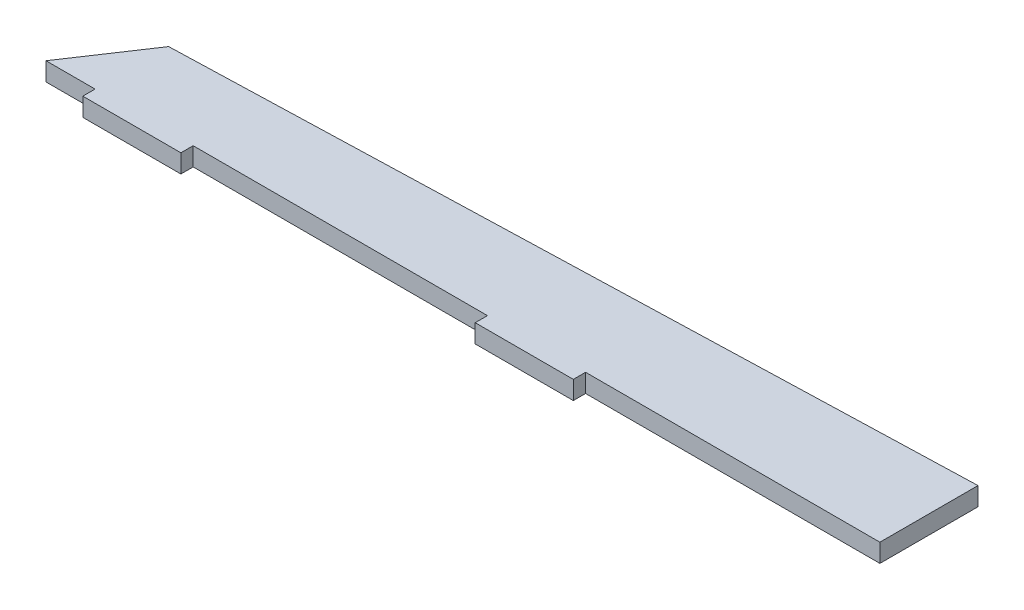
ISO-10303-21;
HEADER;
FILE_DESCRIPTION(('STEP AP214'),'2;1');
FILE_NAME('part.step','',(''),(''),'','','');
FILE_SCHEMA(('AUTOMOTIVE_DESIGN { 1 0 10303 214 1 1 1 1 }'));
ENDSEC;
DATA;
#1=APPLICATION_CONTEXT('core data for automotive mechanical design processes');
#2=APPLICATION_PROTOCOL_DEFINITION('international standard','automotive_design',2000,#1);
#3=PRODUCT_CONTEXT('',#1,'mechanical');
#4=PRODUCT('Part','Part','',(#3));
#5=PRODUCT_RELATED_PRODUCT_CATEGORY('part','',(#4));
#6=PRODUCT_DEFINITION_FORMATION('','',#4);
#7=PRODUCT_DEFINITION_CONTEXT('part definition',#1,'design');
#8=PRODUCT_DEFINITION('design','',#6,#7);
#9=PRODUCT_DEFINITION_SHAPE('','',#8);
#10=(LENGTH_UNIT() NAMED_UNIT(*) SI_UNIT(.MILLI.,.METRE.));
#11=(NAMED_UNIT(*) PLANE_ANGLE_UNIT() SI_UNIT($,.RADIAN.));
#12=(NAMED_UNIT(*) SI_UNIT($,.STERADIAN.) SOLID_ANGLE_UNIT());
#13=UNCERTAINTY_MEASURE_WITH_UNIT(LENGTH_MEASURE(1.E-05),#10,'distance_accuracy_value','');
#14=(GEOMETRIC_REPRESENTATION_CONTEXT(3) GLOBAL_UNCERTAINTY_ASSIGNED_CONTEXT((#13)) GLOBAL_UNIT_ASSIGNED_CONTEXT((#10,
#11,#12)) REPRESENTATION_CONTEXT('',''));
#15=CARTESIAN_POINT('',(0.,0.,0.));
#16=DIRECTION('',(0.,0.,1.));
#17=DIRECTION('',(1.,0.,0.));
#18=AXIS2_PLACEMENT_3D('',#15,#16,#17);
#19=CARTESIAN_POINT('',(0.,4.7625,0.));
#20=DIRECTION('',(0.,0.,-1.));
#21=DIRECTION('',(-1.,0.,0.));
#22=AXIS2_PLACEMENT_3D('',#19,#20,#21);
#23=PLANE('',#22);
#24=DIRECTION('',(1.,0.,0.));
#25=VECTOR('',#24,1.);
#26=CARTESIAN_POINT('',(0.,0.,0.));
#27=LINE('',#26,#25);
#28=CARTESIAN_POINT('',(-177.8,0.,0.));
#29=VERTEX_POINT('',#28);
#30=CARTESIAN_POINT('',(-101.6,0.,0.));
#31=VERTEX_POINT('',#30);
#32=EDGE_CURVE('E186',#29,#31,#27,.T.);
#33=ORIENTED_EDGE('',*,*,#32,.T.);
#34=DIRECTION('',(0.,1.,0.));
#35=VECTOR('',#34,1.);
#36=CARTESIAN_POINT('',(-101.6,-25.5976683508479,0.));
#37=LINE('',#36,#35);
#38=CARTESIAN_POINT('',(-101.6,4.7625,0.));
#39=VERTEX_POINT('',#38);
#40=EDGE_CURVE('E60',#31,#39,#37,.T.);
#41=ORIENTED_EDGE('',*,*,#40,.T.);
#42=DIRECTION('',(1.,0.,0.));
#43=VECTOR('',#42,1.);
#44=CARTESIAN_POINT('',(0.,4.7625,0.));
#45=LINE('',#44,#43);
#46=CARTESIAN_POINT('',(-177.8,4.7625,0.));
#47=VERTEX_POINT('',#46);
#48=EDGE_CURVE('E151',#47,#39,#45,.T.);
#49=ORIENTED_EDGE('',*,*,#48,.F.);
#50=DIRECTION('',(0.,1.,0.));
#51=VECTOR('',#50,1.);
#52=CARTESIAN_POINT('',(-177.8,-25.5976683508479,0.));
#53=LINE('',#52,#51);
#54=EDGE_CURVE('E178',#29,#47,#53,.T.);
#55=ORIENTED_EDGE('',*,*,#54,.F.);
#56=EDGE_LOOP('',(#33,#41,#49,#55));
#57=FACE_BOUND('',#56,.T.);
#58=ADVANCED_FACE('F35',(#57),#23,.F.);
#59=CARTESIAN_POINT('',(-76.2,4.7625,0.));
#60=VERTEX_POINT('',#59);
#61=CARTESIAN_POINT('',(0.,4.7625,0.));
#62=VERTEX_POINT('',#61);
#63=EDGE_CURVE('E39',#60,#62,#45,.T.);
#64=ORIENTED_EDGE('',*,*,#63,.F.);
#65=DIRECTION('',(0.,1.,0.));
#66=VECTOR('',#65,1.);
#67=CARTESIAN_POINT('',(-76.2,-25.5976683508479,0.));
#68=LINE('',#67,#66);
#69=CARTESIAN_POINT('',(-76.2,0.,0.));
#70=VERTEX_POINT('',#69);
#71=EDGE_CURVE('E159',#70,#60,#68,.T.);
#72=ORIENTED_EDGE('',*,*,#71,.F.);
#73=CARTESIAN_POINT('',(0.,0.,0.));
#74=VERTEX_POINT('',#73);
#75=EDGE_CURVE('E184',#70,#74,#27,.T.);
#76=ORIENTED_EDGE('',*,*,#75,.T.);
#77=DIRECTION('',(0.,-1.,0.));
#78=VECTOR('',#77,1.);
#79=CARTESIAN_POINT('',(0.,4.7625,0.));
#80=LINE('',#79,#78);
#81=EDGE_CURVE('E45',#62,#74,#80,.T.);
#82=ORIENTED_EDGE('',*,*,#81,.F.);
#83=EDGE_LOOP('',(#64,#72,#76,#82));
#84=FACE_BOUND('',#83,.T.);
#85=ADVANCED_FACE('F246',(#84),#23,.F.);
#86=CARTESIAN_POINT('',(-215.9,4.7625,0.));
#87=DIRECTION('',(0.832050294337844,0.,0.554700196225229));
#88=DIRECTION('',(0.554700196225229,0.,-0.832050294337844));
#89=AXIS2_PLACEMENT_3D('',#86,#87,#88);
#90=PLANE('',#89);
#91=DIRECTION('',(-0.554700196225229,0.,0.832050294337844));
#92=VECTOR('',#91,1.);
#93=CARTESIAN_POINT('',(-215.9,0.,0.));
#94=LINE('',#93,#92);
#95=CARTESIAN_POINT('',(-203.2,0.,-19.05));
#96=VERTEX_POINT('',#95);
#97=CARTESIAN_POINT('',(-215.9,0.,0.));
#98=VERTEX_POINT('',#97);
#99=EDGE_CURVE('E187',#96,#98,#94,.T.);
#100=ORIENTED_EDGE('',*,*,#99,.T.);
#101=DIRECTION('',(0.,-1.,0.));
#102=VECTOR('',#101,1.);
#103=CARTESIAN_POINT('',(-215.9,4.7625,0.));
#104=LINE('',#103,#102);
#105=CARTESIAN_POINT('',(-215.9,4.7625,0.));
#106=VERTEX_POINT('',#105);
#107=EDGE_CURVE('E11',#106,#98,#104,.T.);
#108=ORIENTED_EDGE('',*,*,#107,.F.);
#109=DIRECTION('',(-0.554700196225229,0.,0.832050294337844));
#110=VECTOR('',#109,1.);
#111=CARTESIAN_POINT('',(-215.9,4.7625,0.));
#112=LINE('',#111,#110);
#113=CARTESIAN_POINT('',(-203.2,4.7625,-19.05));
#114=VERTEX_POINT('',#113);
#115=EDGE_CURVE('E210',#114,#106,#112,.T.);
#116=ORIENTED_EDGE('',*,*,#115,.F.);
#117=DIRECTION('',(0.,-1.,0.));
#118=VECTOR('',#117,1.);
#119=CARTESIAN_POINT('',(-203.2,4.7625,-19.05));
#120=LINE('',#119,#118);
#121=EDGE_CURVE('E206',#114,#96,#120,.T.);
#122=ORIENTED_EDGE('',*,*,#121,.T.);
#123=EDGE_LOOP('',(#100,#108,#116,#122));
#124=FACE_BOUND('',#123,.T.);
#125=ADVANCED_FACE('F37',(#124),#90,.F.);
#126=CARTESIAN_POINT('',(-203.2,0.,0.));
#127=VERTEX_POINT('',#126);
#128=EDGE_CURVE('E199',#98,#127,#27,.T.);
#129=ORIENTED_EDGE('',*,*,#128,.T.);
#130=DIRECTION('',(0.,1.,0.));
#131=VECTOR('',#130,1.);
#132=CARTESIAN_POINT('',(-203.2,-25.5976683508479,0.));
#133=LINE('',#132,#131);
#134=CARTESIAN_POINT('',(-203.2,4.7625,0.));
#135=VERTEX_POINT('',#134);
#136=EDGE_CURVE('E174',#127,#135,#133,.T.);
#137=ORIENTED_EDGE('',*,*,#136,.T.);
#138=EDGE_CURVE('E243',#106,#135,#45,.T.);
#139=ORIENTED_EDGE('',*,*,#138,.F.);
#140=ORIENTED_EDGE('',*,*,#107,.T.);
#141=EDGE_LOOP('',(#129,#137,#139,#140));
#142=FACE_BOUND('',#141,.T.);
#143=ADVANCED_FACE('F260',(#142),#23,.F.);
#144=CARTESIAN_POINT('',(0.,4.7625,-25.4));
#145=DIRECTION('',(-1.,0.,0.));
#146=DIRECTION('',(0.,0.,1.));
#147=AXIS2_PLACEMENT_3D('',#144,#145,#146);
#148=PLANE('',#147);
#149=DIRECTION('',(0.,0.,-1.));
#150=VECTOR('',#149,1.);
#151=CARTESIAN_POINT('',(0.,0.,-25.4));
#152=LINE('',#151,#150);
#153=CARTESIAN_POINT('',(0.,0.,-25.4));
#154=VERTEX_POINT('',#153);
#155=EDGE_CURVE('E192',#74,#154,#152,.T.);
#156=ORIENTED_EDGE('',*,*,#155,.T.);
#157=DIRECTION('',(0.,-1.,0.));
#158=VECTOR('',#157,1.);
#159=CARTESIAN_POINT('',(0.,4.7625,-25.4));
#160=LINE('',#159,#158);
#161=CARTESIAN_POINT('',(0.,4.7625,-25.4));
#162=VERTEX_POINT('',#161);
#163=EDGE_CURVE('E203',#162,#154,#160,.T.);
#164=ORIENTED_EDGE('',*,*,#163,.F.);
#165=DIRECTION('',(0.,0.,-1.));
#166=VECTOR('',#165,1.);
#167=CARTESIAN_POINT('',(0.,4.7625,-25.4));
#168=LINE('',#167,#166);
#169=EDGE_CURVE('E238',#62,#162,#168,.T.);
#170=ORIENTED_EDGE('',*,*,#169,.F.);
#171=ORIENTED_EDGE('',*,*,#81,.T.);
#172=EDGE_LOOP('',(#156,#164,#170,#171));
#173=FACE_BOUND('',#172,.T.);
#174=ADVANCED_FACE('F218',(#173),#148,.F.);
#175=CARTESIAN_POINT('',(-203.2,4.7625,-19.05));
#176=DIRECTION('',(0.0312347523777213,0.,0.999512076087079));
#177=DIRECTION('',(0.999512076087079,0.,-0.0312347523777213));
#178=AXIS2_PLACEMENT_3D('',#175,#176,#177);
#179=PLANE('',#178);
#180=DIRECTION('',(-0.999512076087079,0.,0.0312347523777213));
#181=VECTOR('',#180,1.);
#182=CARTESIAN_POINT('',(-203.2,0.,-19.05));
#183=LINE('',#182,#181);
#184=EDGE_CURVE('E209',#154,#96,#183,.T.);
#185=ORIENTED_EDGE('',*,*,#184,.T.);
#186=ORIENTED_EDGE('',*,*,#121,.F.);
#187=DIRECTION('',(-0.999512076087079,0.,0.0312347523777213));
#188=VECTOR('',#187,1.);
#189=CARTESIAN_POINT('',(-203.2,4.7625,-19.05));
#190=LINE('',#189,#188);
#191=EDGE_CURVE('E208',#162,#114,#190,.T.);
#192=ORIENTED_EDGE('',*,*,#191,.F.);
#193=ORIENTED_EDGE('',*,*,#163,.T.);
#194=EDGE_LOOP('',(#185,#186,#192,#193));
#195=FACE_BOUND('',#194,.T.);
#196=ADVANCED_FACE('F222',(#195),#179,.F.);
#197=CARTESIAN_POINT('',(0.,4.7625,0.));
#198=DIRECTION('',(0.,1.,0.));
#199=DIRECTION('',(0.,0.,1.));
#200=AXIS2_PLACEMENT_3D('',#197,#198,#199);
#201=PLANE('',#200);
#202=ORIENTED_EDGE('',*,*,#115,.T.);
#203=ORIENTED_EDGE('',*,*,#138,.T.);
#204=DIRECTION('',(0.,0.,1.));
#205=VECTOR('',#204,1.);
#206=CARTESIAN_POINT('',(-203.2,4.7625,0.));
#207=LINE('',#206,#205);
#208=CARTESIAN_POINT('',(-203.2,4.7625,3.17500000000004));
#209=VERTEX_POINT('',#208);
#210=EDGE_CURVE('E164',#135,#209,#207,.T.);
#211=ORIENTED_EDGE('',*,*,#210,.T.);
#212=DIRECTION('',(1.,0.,0.));
#213=VECTOR('',#212,1.);
#214=CARTESIAN_POINT('',(-203.2,4.7625,3.17500000000004));
#215=LINE('',#214,#213);
#216=CARTESIAN_POINT('',(-177.8,4.7625,3.17500000000003));
#217=VERTEX_POINT('',#216);
#218=EDGE_CURVE('E165',#209,#217,#215,.T.);
#219=ORIENTED_EDGE('',*,*,#218,.T.);
#220=DIRECTION('',(0.,0.,-1.));
#221=VECTOR('',#220,1.);
#222=CARTESIAN_POINT('',(-177.8,4.7625,0.));
#223=LINE('',#222,#221);
#224=EDGE_CURVE('E168',#217,#47,#223,.T.);
#225=ORIENTED_EDGE('',*,*,#224,.T.);
#226=ORIENTED_EDGE('',*,*,#48,.T.);
#227=DIRECTION('',(0.,0.,1.));
#228=VECTOR('',#227,1.);
#229=CARTESIAN_POINT('',(-101.6,4.7625,0.));
#230=LINE('',#229,#228);
#231=CARTESIAN_POINT('',(-101.6,4.7625,3.175));
#232=VERTEX_POINT('',#231);
#233=EDGE_CURVE('E132',#39,#232,#230,.T.);
#234=ORIENTED_EDGE('',*,*,#233,.T.);
#235=DIRECTION('',(1.,0.,0.));
#236=VECTOR('',#235,1.);
#237=CARTESIAN_POINT('',(-101.6,4.7625,3.175));
#238=LINE('',#237,#236);
#239=CARTESIAN_POINT('',(-76.2,4.7625,3.175));
#240=VERTEX_POINT('',#239);
#241=EDGE_CURVE('E141',#232,#240,#238,.T.);
#242=ORIENTED_EDGE('',*,*,#241,.T.);
#243=DIRECTION('',(0.,0.,-1.));
#244=VECTOR('',#243,1.);
#245=CARTESIAN_POINT('',(-76.2,4.7625,0.));
#246=LINE('',#245,#244);
#247=EDGE_CURVE('E138',#240,#60,#246,.T.);
#248=ORIENTED_EDGE('',*,*,#247,.T.);
#249=ORIENTED_EDGE('',*,*,#63,.T.);
#250=ORIENTED_EDGE('',*,*,#169,.T.);
#251=ORIENTED_EDGE('',*,*,#191,.T.);
#252=EDGE_LOOP('',(#202,#203,#211,#219,#225,#226,#234,#242,#248,#249,#250,#251));
#253=FACE_BOUND('',#252,.T.);
#254=ADVANCED_FACE('F149',(#253),#201,.T.);
#255=CARTESIAN_POINT('',(0.,0.,0.));
#256=DIRECTION('',(0.,1.,0.));
#257=DIRECTION('',(0.,0.,1.));
#258=AXIS2_PLACEMENT_3D('',#255,#256,#257);
#259=PLANE('',#258);
#260=ORIENTED_EDGE('',*,*,#99,.F.);
#261=ORIENTED_EDGE('',*,*,#184,.F.);
#262=ORIENTED_EDGE('',*,*,#155,.F.);
#263=ORIENTED_EDGE('',*,*,#75,.F.);
#264=DIRECTION('',(0.,0.,1.));
#265=VECTOR('',#264,1.);
#266=CARTESIAN_POINT('',(-76.2,0.,0.));
#267=LINE('',#266,#265);
#268=CARTESIAN_POINT('',(-76.2,0.,3.175));
#269=VERTEX_POINT('',#268);
#270=EDGE_CURVE('E158',#70,#269,#267,.T.);
#271=ORIENTED_EDGE('',*,*,#270,.T.);
#272=DIRECTION('',(-1.,0.,0.));
#273=VECTOR('',#272,1.);
#274=CARTESIAN_POINT('',(-101.6,0.,3.175));
#275=LINE('',#274,#273);
#276=CARTESIAN_POINT('',(-101.6,0.,3.175));
#277=VERTEX_POINT('',#276);
#278=EDGE_CURVE('E162',#269,#277,#275,.T.);
#279=ORIENTED_EDGE('',*,*,#278,.T.);
#280=DIRECTION('',(0.,0.,-1.));
#281=VECTOR('',#280,1.);
#282=CARTESIAN_POINT('',(-101.6,0.,0.));
#283=LINE('',#282,#281);
#284=EDGE_CURVE('E134',#277,#31,#283,.T.);
#285=ORIENTED_EDGE('',*,*,#284,.T.);
#286=ORIENTED_EDGE('',*,*,#32,.F.);
#287=DIRECTION('',(0.,0.,1.));
#288=VECTOR('',#287,1.);
#289=CARTESIAN_POINT('',(-177.8,0.,0.));
#290=LINE('',#289,#288);
#291=CARTESIAN_POINT('',(-177.8,0.,3.17500000000003));
#292=VERTEX_POINT('',#291);
#293=EDGE_CURVE('E177',#29,#292,#290,.T.);
#294=ORIENTED_EDGE('',*,*,#293,.T.);
#295=DIRECTION('',(-1.,0.,0.));
#296=VECTOR('',#295,1.);
#297=CARTESIAN_POINT('',(-203.2,0.,3.17500000000004));
#298=LINE('',#297,#296);
#299=CARTESIAN_POINT('',(-203.2,0.,3.17500000000004));
#300=VERTEX_POINT('',#299);
#301=EDGE_CURVE('E229',#292,#300,#298,.T.);
#302=ORIENTED_EDGE('',*,*,#301,.T.);
#303=DIRECTION('',(0.,0.,-1.));
#304=VECTOR('',#303,1.);
#305=CARTESIAN_POINT('',(-203.2,0.,0.));
#306=LINE('',#305,#304);
#307=EDGE_CURVE('E230',#300,#127,#306,.T.);
#308=ORIENTED_EDGE('',*,*,#307,.T.);
#309=ORIENTED_EDGE('',*,*,#128,.F.);
#310=EDGE_LOOP('',(#260,#261,#262,#263,#271,#279,#285,#286,#294,#302,#308,#309));
#311=FACE_BOUND('',#310,.T.);
#312=ADVANCED_FACE('F224',(#311),#259,.F.);
#313=CARTESIAN_POINT('',(-203.2,-25.5976683508479,0.));
#314=DIRECTION('',(-1.,0.,0.));
#315=DIRECTION('',(0.,0.,1.));
#316=AXIS2_PLACEMENT_3D('',#313,#314,#315);
#317=PLANE('',#316);
#318=ORIENTED_EDGE('',*,*,#307,.F.);
#319=DIRECTION('',(0.,1.,0.));
#320=VECTOR('',#319,1.);
#321=CARTESIAN_POINT('',(-203.2,-25.5976683508479,3.17500000000004));
#322=LINE('',#321,#320);
#323=EDGE_CURVE('E235',#300,#209,#322,.T.);
#324=ORIENTED_EDGE('',*,*,#323,.T.);
#325=ORIENTED_EDGE('',*,*,#210,.F.);
#326=ORIENTED_EDGE('',*,*,#136,.F.);
#327=EDGE_LOOP('',(#318,#324,#325,#326));
#328=FACE_BOUND('',#327,.T.);
#329=ADVANCED_FACE('F274',(#328),#317,.T.);
#330=CARTESIAN_POINT('',(-177.8,-25.5976683508479,0.));
#331=DIRECTION('',(1.,0.,0.));
#332=DIRECTION('',(0.,0.,-1.));
#333=AXIS2_PLACEMENT_3D('',#330,#331,#332);
#334=PLANE('',#333);
#335=ORIENTED_EDGE('',*,*,#293,.F.);
#336=ORIENTED_EDGE('',*,*,#54,.T.);
#337=ORIENTED_EDGE('',*,*,#224,.F.);
#338=DIRECTION('',(0.,1.,0.));
#339=VECTOR('',#338,1.);
#340=CARTESIAN_POINT('',(-177.8,-25.5976683508479,3.17500000000003));
#341=LINE('',#340,#339);
#342=EDGE_CURVE('E279',#292,#217,#341,.T.);
#343=ORIENTED_EDGE('',*,*,#342,.F.);
#344=EDGE_LOOP('',(#335,#336,#337,#343));
#345=FACE_BOUND('',#344,.T.);
#346=ADVANCED_FACE('F283',(#345),#334,.T.);
#347=CARTESIAN_POINT('',(-203.2,-25.5976683508479,3.17500000000004));
#348=DIRECTION('',(0.,0.,1.));
#349=DIRECTION('',(1.,0.,0.));
#350=AXIS2_PLACEMENT_3D('',#347,#348,#349);
#351=PLANE('',#350);
#352=ORIENTED_EDGE('',*,*,#301,.F.);
#353=ORIENTED_EDGE('',*,*,#342,.T.);
#354=ORIENTED_EDGE('',*,*,#218,.F.);
#355=ORIENTED_EDGE('',*,*,#323,.F.);
#356=EDGE_LOOP('',(#352,#353,#354,#355));
#357=FACE_BOUND('',#356,.T.);
#358=ADVANCED_FACE('F257',(#357),#351,.T.);
#359=CARTESIAN_POINT('',(-101.6,-25.5976683508479,0.));
#360=DIRECTION('',(-1.,0.,0.));
#361=DIRECTION('',(0.,0.,1.));
#362=AXIS2_PLACEMENT_3D('',#359,#360,#361);
#363=PLANE('',#362);
#364=ORIENTED_EDGE('',*,*,#284,.F.);
#365=DIRECTION('',(0.,1.,0.));
#366=VECTOR('',#365,1.);
#367=CARTESIAN_POINT('',(-101.6,-25.5976683508479,3.175));
#368=LINE('',#367,#366);
#369=EDGE_CURVE('E128',#277,#232,#368,.T.);
#370=ORIENTED_EDGE('',*,*,#369,.T.);
#371=ORIENTED_EDGE('',*,*,#233,.F.);
#372=ORIENTED_EDGE('',*,*,#40,.F.);
#373=EDGE_LOOP('',(#364,#370,#371,#372));
#374=FACE_BOUND('',#373,.T.);
#375=ADVANCED_FACE('F130',(#374),#363,.T.);
#376=CARTESIAN_POINT('',(-76.2,-25.5976683508479,0.));
#377=DIRECTION('',(1.,0.,0.));
#378=DIRECTION('',(0.,0.,-1.));
#379=AXIS2_PLACEMENT_3D('',#376,#377,#378);
#380=PLANE('',#379);
#381=ORIENTED_EDGE('',*,*,#270,.F.);
#382=ORIENTED_EDGE('',*,*,#71,.T.);
#383=ORIENTED_EDGE('',*,*,#247,.F.);
#384=DIRECTION('',(0.,1.,0.));
#385=VECTOR('',#384,1.);
#386=CARTESIAN_POINT('',(-76.2,-25.5976683508479,3.175));
#387=LINE('',#386,#385);
#388=EDGE_CURVE('E137',#269,#240,#387,.T.);
#389=ORIENTED_EDGE('',*,*,#388,.F.);
#390=EDGE_LOOP('',(#381,#382,#383,#389));
#391=FACE_BOUND('',#390,.T.);
#392=ADVANCED_FACE('F249',(#391),#380,.T.);
#393=CARTESIAN_POINT('',(-101.6,-25.5976683508479,3.175));
#394=DIRECTION('',(0.,0.,1.));
#395=DIRECTION('',(1.,0.,0.));
#396=AXIS2_PLACEMENT_3D('',#393,#394,#395);
#397=PLANE('',#396);
#398=ORIENTED_EDGE('',*,*,#278,.F.);
#399=ORIENTED_EDGE('',*,*,#388,.T.);
#400=ORIENTED_EDGE('',*,*,#241,.F.);
#401=ORIENTED_EDGE('',*,*,#369,.F.);
#402=EDGE_LOOP('',(#398,#399,#400,#401));
#403=FACE_BOUND('',#402,.T.);
#404=ADVANCED_FACE('F142',(#403),#397,.T.);
#405=CLOSED_SHELL('',(#58,#85,#125,#143,#174,#196,#254,#312,#329,#346,#358,#375,#392,#404));
#406=MANIFOLD_SOLID_BREP('B2',#405);
#407=ADVANCED_BREP_SHAPE_REPRESENTATION('',(#18,#406),#14);
#408=SHAPE_DEFINITION_REPRESENTATION(#9,#407);
ENDSEC;
END-ISO-10303-21;
